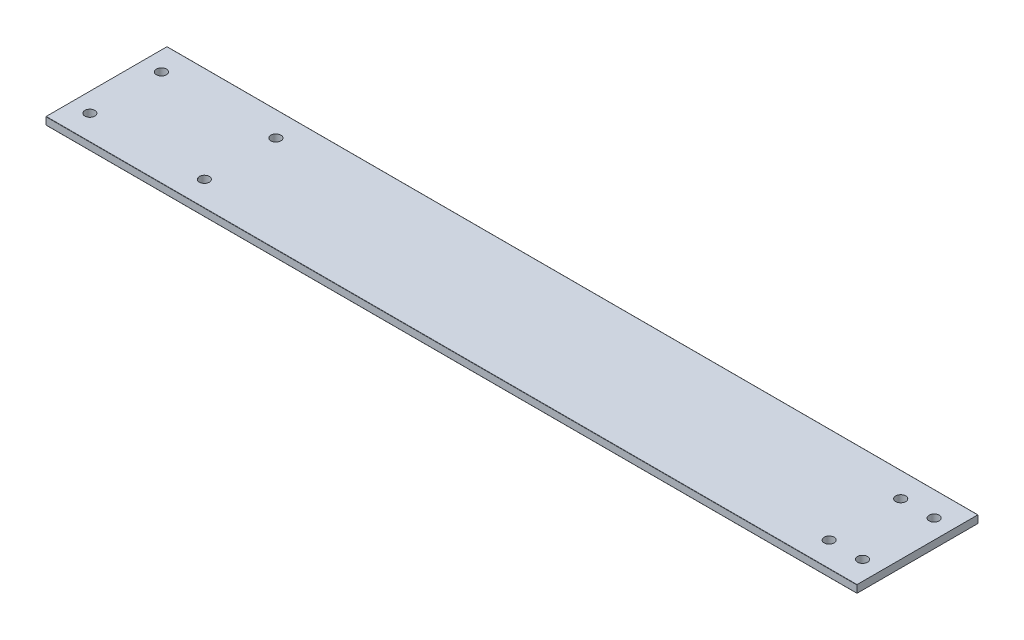
ISO-10303-21;
HEADER;
FILE_DESCRIPTION(('STEP AP214'),'2;1');
FILE_NAME('part.step','',(''),(''),'','','');
FILE_SCHEMA(('AUTOMOTIVE_DESIGN { 1 0 10303 214 1 1 1 1 }'));
ENDSEC;
DATA;
#1=APPLICATION_CONTEXT('core data for automotive mechanical design processes');
#2=APPLICATION_PROTOCOL_DEFINITION('international standard','automotive_design',2000,#1);
#3=PRODUCT_CONTEXT('',#1,'mechanical');
#4=PRODUCT('Part','Part','',(#3));
#5=PRODUCT_RELATED_PRODUCT_CATEGORY('part','',(#4));
#6=PRODUCT_DEFINITION_FORMATION('','',#4);
#7=PRODUCT_DEFINITION_CONTEXT('part definition',#1,'design');
#8=PRODUCT_DEFINITION('design','',#6,#7);
#9=PRODUCT_DEFINITION_SHAPE('','',#8);
#10=(LENGTH_UNIT() NAMED_UNIT(*) SI_UNIT(.MILLI.,.METRE.));
#11=(NAMED_UNIT(*) PLANE_ANGLE_UNIT() SI_UNIT($,.RADIAN.));
#12=(NAMED_UNIT(*) SI_UNIT($,.STERADIAN.) SOLID_ANGLE_UNIT());
#13=UNCERTAINTY_MEASURE_WITH_UNIT(LENGTH_MEASURE(1.E-05),#10,'distance_accuracy_value','');
#14=(GEOMETRIC_REPRESENTATION_CONTEXT(3) GLOBAL_UNCERTAINTY_ASSIGNED_CONTEXT((#13)) GLOBAL_UNIT_ASSIGNED_CONTEXT((#10,
#11,#12)) REPRESENTATION_CONTEXT('',''));
#15=CARTESIAN_POINT('',(0.,0.,0.));
#16=DIRECTION('',(0.,0.,1.));
#17=DIRECTION('',(1.,0.,0.));
#18=AXIS2_PLACEMENT_3D('',#15,#16,#17);
#19=CARTESIAN_POINT('',(-304.8,-1.58750000000001,-25.4));
#20=DIRECTION('',(-1.,0.,0.));
#21=DIRECTION('',(0.,0.,1.));
#22=AXIS2_PLACEMENT_3D('',#19,#20,#21);
#23=PLANE('',#22);
#24=DIRECTION('',(0.,0.,1.));
#25=VECTOR('',#24,1.);
#26=CARTESIAN_POINT('',(-304.8,-1.58750000000001,-25.4));
#27=LINE('',#26,#25);
#28=CARTESIAN_POINT('',(-304.8,-1.58750000000001,-25.295225));
#29=VERTEX_POINT('',#28);
#30=CARTESIAN_POINT('',(-304.8,-1.58750000000001,25.2952249999999));
#31=VERTEX_POINT('',#30);
#32=EDGE_CURVE('E176',#29,#31,#27,.T.);
#33=ORIENTED_EDGE('',*,*,#32,.T.);
#34=CARTESIAN_POINT('',(-304.8,-1.48272500000001,25.295225));
#35=DIRECTION('',(-1.,0.,0.));
#36=DIRECTION('',(0.,0.,1.));
#37=AXIS2_PLACEMENT_3D('',#34,#35,#36);
#38=CIRCLE('',#37,0.104775);
#39=CARTESIAN_POINT('',(-304.8,-1.48272500000001,25.4));
#40=VERTEX_POINT('',#39);
#41=EDGE_CURVE('E153',#31,#40,#38,.T.);
#42=ORIENTED_EDGE('',*,*,#41,.T.);
#43=DIRECTION('',(0.,1.,0.));
#44=VECTOR('',#43,1.);
#45=CARTESIAN_POINT('',(-304.8,-1.58750000000001,25.4));
#46=LINE('',#45,#44);
#47=CARTESIAN_POINT('',(-304.8,1.48272499999999,25.4));
#48=VERTEX_POINT('',#47);
#49=EDGE_CURVE('E136',#40,#48,#46,.T.);
#50=ORIENTED_EDGE('',*,*,#49,.T.);
#51=CARTESIAN_POINT('',(-304.8,1.48272499999999,25.295225));
#52=DIRECTION('',(-1.,0.,0.));
#53=DIRECTION('',(0.,0.,1.));
#54=AXIS2_PLACEMENT_3D('',#51,#52,#53);
#55=CIRCLE('',#54,0.104775);
#56=CARTESIAN_POINT('',(-304.8,1.58749999999999,25.2952249999999));
#57=VERTEX_POINT('',#56);
#58=EDGE_CURVE('E125',#48,#57,#55,.T.);
#59=ORIENTED_EDGE('',*,*,#58,.T.);
#60=DIRECTION('',(0.,0.,1.));
#61=VECTOR('',#60,1.);
#62=CARTESIAN_POINT('',(-304.8,1.58749999999999,-25.4));
#63=LINE('',#62,#61);
#64=CARTESIAN_POINT('',(-304.8,1.58749999999999,-25.295225));
#65=VERTEX_POINT('',#64);
#66=EDGE_CURVE('E170',#65,#57,#63,.T.);
#67=ORIENTED_EDGE('',*,*,#66,.F.);
#68=CARTESIAN_POINT('',(-304.8,1.48272499999999,-25.295225));
#69=DIRECTION('',(-1.,0.,0.));
#70=DIRECTION('',(0.,0.,1.));
#71=AXIS2_PLACEMENT_3D('',#68,#69,#70);
#72=CIRCLE('',#71,0.104775);
#73=CARTESIAN_POINT('',(-304.8,1.48272499999999,-25.4));
#74=VERTEX_POINT('',#73);
#75=EDGE_CURVE('E65',#65,#74,#72,.T.);
#76=ORIENTED_EDGE('',*,*,#75,.T.);
#77=DIRECTION('',(0.,1.,0.));
#78=VECTOR('',#77,1.);
#79=CARTESIAN_POINT('',(-304.8,-1.58750000000001,-25.4));
#80=LINE('',#79,#78);
#81=CARTESIAN_POINT('',(-304.8,-1.48272500000001,-25.4));
#82=VERTEX_POINT('',#81);
#83=EDGE_CURVE('E127',#82,#74,#80,.T.);
#84=ORIENTED_EDGE('',*,*,#83,.F.);
#85=CARTESIAN_POINT('',(-304.8,-1.48272500000001,-25.295225));
#86=DIRECTION('',(-1.,0.,0.));
#87=DIRECTION('',(0.,0.,1.));
#88=AXIS2_PLACEMENT_3D('',#85,#86,#87);
#89=CIRCLE('',#88,0.104775);
#90=EDGE_CURVE('E150',#82,#29,#89,.T.);
#91=ORIENTED_EDGE('',*,*,#90,.T.);
#92=EDGE_LOOP('',(#33,#42,#50,#59,#67,#76,#84,#91));
#93=FACE_BOUND('',#92,.T.);
#94=ADVANCED_FACE('F43',(#93),#23,.T.);
#95=CARTESIAN_POINT('',(-304.8,-1.58750000000001,-25.4));
#96=DIRECTION('',(0.,0.,-1.));
#97=DIRECTION('',(-1.,0.,0.));
#98=AXIS2_PLACEMENT_3D('',#95,#96,#97);
#99=PLANE('',#98);
#100=DIRECTION('',(0.,1.,0.));
#101=VECTOR('',#100,1.);
#102=CARTESIAN_POINT('',(35.1999999999999,-1.58749999998689,-25.4000000000027));
#103=LINE('',#102,#101);
#104=CARTESIAN_POINT('',(35.1999999999999,-1.48272500000001,-25.4000000000027));
#105=VERTEX_POINT('',#104);
#106=CARTESIAN_POINT('',(35.1999999999999,1.48272499999999,-25.4000000000027));
#107=VERTEX_POINT('',#106);
#108=EDGE_CURVE('E187',#105,#107,#103,.T.);
#109=ORIENTED_EDGE('',*,*,#108,.F.);
#110=DIRECTION('',(-1.,0.,0.));
#111=VECTOR('',#110,1.);
#112=CARTESIAN_POINT('',(-304.8,-1.48272500000001,-25.4));
#113=LINE('',#112,#111);
#114=EDGE_CURVE('E160',#105,#82,#113,.T.);
#115=ORIENTED_EDGE('',*,*,#114,.T.);
#116=ORIENTED_EDGE('',*,*,#83,.T.);
#117=DIRECTION('',(-1.,0.,0.));
#118=VECTOR('',#117,1.);
#119=CARTESIAN_POINT('',(-304.8,1.48272499999999,-25.4));
#120=LINE('',#119,#118);
#121=EDGE_CURVE('E156',#74,#107,#120,.F.);
#122=ORIENTED_EDGE('',*,*,#121,.T.);
#123=EDGE_LOOP('',(#109,#115,#116,#122));
#124=FACE_BOUND('',#123,.T.);
#125=ADVANCED_FACE('F265',(#124),#99,.T.);
#126=CARTESIAN_POINT('',(-304.8,-1.58750000000001,25.4));
#127=DIRECTION('',(0.,0.,1.));
#128=DIRECTION('',(1.,0.,0.));
#129=AXIS2_PLACEMENT_3D('',#126,#127,#128);
#130=PLANE('',#129);
#131=DIRECTION('',(0.,-1.,0.));
#132=VECTOR('',#131,1.);
#133=CARTESIAN_POINT('',(35.1999999999999,-1.58749999998689,25.3999999999973));
#134=LINE('',#133,#132);
#135=CARTESIAN_POINT('',(35.1999999999999,1.48272499999999,25.3999999999973));
#136=VERTEX_POINT('',#135);
#137=CARTESIAN_POINT('',(35.1999999999999,-1.48272500000001,25.3999999999973));
#138=VERTEX_POINT('',#137);
#139=EDGE_CURVE('E108',#136,#138,#134,.T.);
#140=ORIENTED_EDGE('',*,*,#139,.F.);
#141=DIRECTION('',(1.,0.,0.));
#142=VECTOR('',#141,1.);
#143=CARTESIAN_POINT('',(-304.8,1.48272499999999,25.4));
#144=LINE('',#143,#142);
#145=EDGE_CURVE('E118',#136,#48,#144,.F.);
#146=ORIENTED_EDGE('',*,*,#145,.T.);
#147=ORIENTED_EDGE('',*,*,#49,.F.);
#148=DIRECTION('',(1.,0.,0.));
#149=VECTOR('',#148,1.);
#150=CARTESIAN_POINT('',(304.8,-1.48272500000001,25.4));
#151=LINE('',#150,#149);
#152=EDGE_CURVE('E121',#40,#138,#151,.T.);
#153=ORIENTED_EDGE('',*,*,#152,.T.);
#154=EDGE_LOOP('',(#140,#146,#147,#153));
#155=FACE_BOUND('',#154,.T.);
#156=ADVANCED_FACE('F116',(#155),#130,.T.);
#157=CARTESIAN_POINT('',(0.,-1.58750000000001,0.));
#158=DIRECTION('',(0.,1.,0.));
#159=DIRECTION('',(0.,0.,1.));
#160=AXIS2_PLACEMENT_3D('',#157,#158,#159);
#161=PLANE('',#160);
#162=CARTESIAN_POINT('',(27.1999999999999,-1.58750000000001,14.9999999999826));
#163=DIRECTION('',(0.,-1.,0.));
#164=DIRECTION('',(0.,0.,-1.));
#165=AXIS2_PLACEMENT_3D('',#162,#163,#164);
#166=CIRCLE('',#165,2.10000000002007);
#167=CARTESIAN_POINT('',(27.1999999999999,-1.58750000000001,12.8999999999625));
#168=VERTEX_POINT('',#167);
#169=EDGE_CURVE('E196',#168,#168,#166,.T.);
#170=ORIENTED_EDGE('',*,*,#169,.F.);
#171=EDGE_LOOP('',(#170));
#172=FACE_BOUND('',#171,.T.);
#173=CARTESIAN_POINT('',(13.1989999999999,-1.58750000000001,14.9999999999826));
#174=DIRECTION('',(0.,-1.,0.));
#175=DIRECTION('',(0.,0.,-1.));
#176=AXIS2_PLACEMENT_3D('',#173,#174,#175);
#177=CIRCLE('',#176,2.10000000002007);
#178=CARTESIAN_POINT('',(13.1989999999999,-1.58750000000001,12.8999999999625));
#179=VERTEX_POINT('',#178);
#180=EDGE_CURVE('E215',#179,#179,#177,.T.);
#181=ORIENTED_EDGE('',*,*,#180,.F.);
#182=EDGE_LOOP('',(#181));
#183=FACE_BOUND('',#182,.T.);
#184=CARTESIAN_POINT('',(13.1989999999999,-1.58750000000001,-15.0000000000174));
#185=DIRECTION('',(0.,-1.,0.));
#186=DIRECTION('',(0.,0.,-1.));
#187=AXIS2_PLACEMENT_3D('',#184,#185,#186);
#188=CIRCLE('',#187,2.10000000002008);
#189=CARTESIAN_POINT('',(13.1989999999999,-1.58750000000001,-17.1000000000375));
#190=VERTEX_POINT('',#189);
#191=EDGE_CURVE('E209',#190,#190,#188,.T.);
#192=ORIENTED_EDGE('',*,*,#191,.F.);
#193=EDGE_LOOP('',(#192));
#194=FACE_BOUND('',#193,.T.);
#195=CARTESIAN_POINT('',(-248.8,-1.58750000000001,-15.0000000000174));
#196=DIRECTION('',(0.,-1.,0.));
#197=DIRECTION('',(0.,0.,-1.));
#198=AXIS2_PLACEMENT_3D('',#195,#196,#197);
#199=CIRCLE('',#198,2.10000000000129);
#200=CARTESIAN_POINT('',(-248.8,-1.58750000000001,-17.1000000000187));
#201=VERTEX_POINT('',#200);
#202=EDGE_CURVE('E202',#201,#201,#199,.T.);
#203=ORIENTED_EDGE('',*,*,#202,.F.);
#204=EDGE_LOOP('',(#203));
#205=FACE_BOUND('',#204,.T.);
#206=CARTESIAN_POINT('',(-248.8,-1.58750000000001,14.9999999999956));
#207=DIRECTION('',(0.,-1.,0.));
#208=DIRECTION('',(0.,0.,-1.));
#209=AXIS2_PLACEMENT_3D('',#206,#207,#208);
#210=CIRCLE('',#209,2.10000000000127);
#211=CARTESIAN_POINT('',(-248.8,-1.58750000000001,12.8999999999943));
#212=VERTEX_POINT('',#211);
#213=EDGE_CURVE('E203',#212,#212,#210,.T.);
#214=ORIENTED_EDGE('',*,*,#213,.F.);
#215=EDGE_LOOP('',(#214));
#216=FACE_BOUND('',#215,.T.);
#217=CARTESIAN_POINT('',(-296.8,-1.58750000000001,14.9999999999826));
#218=DIRECTION('',(0.,-1.,0.));
#219=DIRECTION('',(0.,0.,-1.));
#220=AXIS2_PLACEMENT_3D('',#217,#218,#219);
#221=CIRCLE('',#220,2.10000000000129);
#222=CARTESIAN_POINT('',(-296.8,-1.58750000000001,12.8999999999813));
#223=VERTEX_POINT('',#222);
#224=EDGE_CURVE('E232',#223,#223,#221,.T.);
#225=ORIENTED_EDGE('',*,*,#224,.F.);
#226=EDGE_LOOP('',(#225));
#227=FACE_BOUND('',#226,.T.);
#228=CARTESIAN_POINT('',(-296.8,-1.58750000000001,-15.0000000000044));
#229=DIRECTION('',(0.,-1.,0.));
#230=DIRECTION('',(0.,0.,-1.));
#231=AXIS2_PLACEMENT_3D('',#228,#229,#230);
#232=CIRCLE('',#231,2.10000000000127);
#233=CARTESIAN_POINT('',(-296.8,-1.58750000000001,-17.1000000000057));
#234=VERTEX_POINT('',#233);
#235=EDGE_CURVE('E226',#234,#234,#232,.T.);
#236=ORIENTED_EDGE('',*,*,#235,.F.);
#237=EDGE_LOOP('',(#236));
#238=FACE_BOUND('',#237,.T.);
#239=CARTESIAN_POINT('',(27.1999999999999,-1.58750000000001,-15.0000000000174));
#240=DIRECTION('',(0.,-1.,0.));
#241=DIRECTION('',(0.,0.,-1.));
#242=AXIS2_PLACEMENT_3D('',#239,#240,#241);
#243=CIRCLE('',#242,2.10000000002007);
#244=CARTESIAN_POINT('',(27.1999999999999,-1.58750000000001,-17.1000000000375));
#245=VERTEX_POINT('',#244);
#246=EDGE_CURVE('E193',#245,#245,#243,.T.);
#247=ORIENTED_EDGE('',*,*,#246,.F.);
#248=EDGE_LOOP('',(#247));
#249=FACE_BOUND('',#248,.T.);
#250=DIRECTION('',(-1.,0.,0.));
#251=VECTOR('',#250,1.);
#252=CARTESIAN_POINT('',(304.8,-1.58750000000001,-25.295225));
#253=LINE('',#252,#251);
#254=CARTESIAN_POINT('',(35.1999999999999,-1.58749999998689,-25.295225));
#255=VERTEX_POINT('',#254);
#256=EDGE_CURVE('E133',#29,#255,#253,.F.);
#257=ORIENTED_EDGE('',*,*,#256,.T.);
#258=DIRECTION('',(0.,0.,-1.));
#259=VECTOR('',#258,1.);
#260=CARTESIAN_POINT('',(35.1999999999999,-1.58749999998689,25.3999999999973));
#261=LINE('',#260,#259);
#262=CARTESIAN_POINT('',(35.1999999999999,-1.58749999998689,25.295225));
#263=VERTEX_POINT('',#262);
#264=EDGE_CURVE('E189',#263,#255,#261,.T.);
#265=ORIENTED_EDGE('',*,*,#264,.F.);
#266=DIRECTION('',(1.,0.,0.));
#267=VECTOR('',#266,1.);
#268=CARTESIAN_POINT('',(-304.8,-1.58750000000001,25.295225));
#269=LINE('',#268,#267);
#270=EDGE_CURVE('E143',#263,#31,#269,.F.);
#271=ORIENTED_EDGE('',*,*,#270,.T.);
#272=ORIENTED_EDGE('',*,*,#32,.F.);
#273=EDGE_LOOP('',(#257,#265,#271,#272));
#274=FACE_BOUND('',#273,.T.);
#275=ADVANCED_FACE('F243',(#172,#183,#194,#205,#216,#227,#238,#249,#274),#161,.F.);
#276=CARTESIAN_POINT('',(0.,1.58749999999999,0.));
#277=DIRECTION('',(0.,1.,0.));
#278=DIRECTION('',(0.,0.,1.));
#279=AXIS2_PLACEMENT_3D('',#276,#277,#278);
#280=PLANE('',#279);
#281=CARTESIAN_POINT('',(27.1999999999999,1.58750000001316,14.9999999999826));
#282=DIRECTION('',(0.,-1.,0.));
#283=DIRECTION('',(0.,0.,-1.));
#284=AXIS2_PLACEMENT_3D('',#281,#282,#283);
#285=CIRCLE('',#284,2.10000000002007);
#286=CARTESIAN_POINT('',(27.1999999999999,1.58750000001316,12.8999999999625));
#287=VERTEX_POINT('',#286);
#288=EDGE_CURVE('E218',#287,#287,#285,.T.);
#289=ORIENTED_EDGE('',*,*,#288,.T.);
#290=EDGE_LOOP('',(#289));
#291=FACE_BOUND('',#290,.T.);
#292=CARTESIAN_POINT('',(13.1989999999999,1.58750000001316,14.9999999999826));
#293=DIRECTION('',(0.,-1.,0.));
#294=DIRECTION('',(0.,0.,-1.));
#295=AXIS2_PLACEMENT_3D('',#292,#293,#294);
#296=CIRCLE('',#295,2.10000000002007);
#297=CARTESIAN_POINT('',(13.1989999999999,1.58750000001316,12.8999999999625));
#298=VERTEX_POINT('',#297);
#299=EDGE_CURVE('E212',#298,#298,#296,.T.);
#300=ORIENTED_EDGE('',*,*,#299,.T.);
#301=EDGE_LOOP('',(#300));
#302=FACE_BOUND('',#301,.T.);
#303=CARTESIAN_POINT('',(13.1989999999999,1.58750000001316,-15.0000000000174));
#304=DIRECTION('',(0.,-1.,0.));
#305=DIRECTION('',(0.,0.,-1.));
#306=AXIS2_PLACEMENT_3D('',#303,#304,#305);
#307=CIRCLE('',#306,2.10000000002008);
#308=CARTESIAN_POINT('',(13.1989999999999,1.58750000001316,-17.1000000000375));
#309=VERTEX_POINT('',#308);
#310=EDGE_CURVE('E206',#309,#309,#307,.T.);
#311=ORIENTED_EDGE('',*,*,#310,.T.);
#312=EDGE_LOOP('',(#311));
#313=FACE_BOUND('',#312,.T.);
#314=CARTESIAN_POINT('',(-248.8,1.58750000001316,-15.0000000000174));
#315=DIRECTION('',(0.,-1.,0.));
#316=DIRECTION('',(0.,0.,-1.));
#317=AXIS2_PLACEMENT_3D('',#314,#315,#316);
#318=CIRCLE('',#317,2.10000000000129);
#319=CARTESIAN_POINT('',(-248.8,1.58750000001316,-17.1000000000187));
#320=VERTEX_POINT('',#319);
#321=EDGE_CURVE('E199',#320,#320,#318,.T.);
#322=ORIENTED_EDGE('',*,*,#321,.T.);
#323=EDGE_LOOP('',(#322));
#324=FACE_BOUND('',#323,.T.);
#325=CARTESIAN_POINT('',(-248.8,1.58750000001316,14.9999999999956));
#326=DIRECTION('',(0.,-1.,0.));
#327=DIRECTION('',(0.,0.,-1.));
#328=AXIS2_PLACEMENT_3D('',#325,#326,#327);
#329=CIRCLE('',#328,2.10000000000127);
#330=CARTESIAN_POINT('',(-248.8,1.58750000001316,12.8999999999943));
#331=VERTEX_POINT('',#330);
#332=EDGE_CURVE('E235',#331,#331,#329,.T.);
#333=ORIENTED_EDGE('',*,*,#332,.T.);
#334=EDGE_LOOP('',(#333));
#335=FACE_BOUND('',#334,.T.);
#336=CARTESIAN_POINT('',(-296.8,1.58750000001316,14.9999999999826));
#337=DIRECTION('',(0.,-1.,0.));
#338=DIRECTION('',(0.,0.,-1.));
#339=AXIS2_PLACEMENT_3D('',#336,#337,#338);
#340=CIRCLE('',#339,2.10000000000129);
#341=CARTESIAN_POINT('',(-296.8,1.58750000001316,12.8999999999813));
#342=VERTEX_POINT('',#341);
#343=EDGE_CURVE('E229',#342,#342,#340,.T.);
#344=ORIENTED_EDGE('',*,*,#343,.T.);
#345=EDGE_LOOP('',(#344));
#346=FACE_BOUND('',#345,.T.);
#347=CARTESIAN_POINT('',(-296.8,1.58750000001316,-15.0000000000044));
#348=DIRECTION('',(0.,-1.,0.));
#349=DIRECTION('',(0.,0.,-1.));
#350=AXIS2_PLACEMENT_3D('',#347,#348,#349);
#351=CIRCLE('',#350,2.10000000000127);
#352=CARTESIAN_POINT('',(-296.8,1.58750000001316,-17.1000000000057));
#353=VERTEX_POINT('',#352);
#354=EDGE_CURVE('E223',#353,#353,#351,.T.);
#355=ORIENTED_EDGE('',*,*,#354,.T.);
#356=EDGE_LOOP('',(#355));
#357=FACE_BOUND('',#356,.T.);
#358=CARTESIAN_POINT('',(27.1999999999999,1.58750000001316,-15.0000000000174));
#359=DIRECTION('',(0.,-1.,0.));
#360=DIRECTION('',(0.,0.,-1.));
#361=AXIS2_PLACEMENT_3D('',#358,#359,#360);
#362=CIRCLE('',#361,2.10000000002007);
#363=CARTESIAN_POINT('',(27.1999999999999,1.58750000001316,-17.1000000000375));
#364=VERTEX_POINT('',#363);
#365=EDGE_CURVE('E192',#364,#364,#362,.T.);
#366=ORIENTED_EDGE('',*,*,#365,.T.);
#367=EDGE_LOOP('',(#366));
#368=FACE_BOUND('',#367,.T.);
#369=DIRECTION('',(0.,0.,1.));
#370=VECTOR('',#369,1.);
#371=CARTESIAN_POINT('',(35.1999999999999,1.58750000001316,25.3999999999973));
#372=LINE('',#371,#370);
#373=CARTESIAN_POINT('',(35.1999999999999,1.58750000001316,-25.295225));
#374=VERTEX_POINT('',#373);
#375=CARTESIAN_POINT('',(35.1999999999999,1.58749999999999,25.295225));
#376=VERTEX_POINT('',#375);
#377=EDGE_CURVE('E57',#374,#376,#372,.T.);
#378=ORIENTED_EDGE('',*,*,#377,.F.);
#379=DIRECTION('',(-1.,0.,0.));
#380=VECTOR('',#379,1.);
#381=CARTESIAN_POINT('',(0.,1.58749999999999,-25.295225));
#382=LINE('',#381,#380);
#383=EDGE_CURVE('E51',#374,#65,#382,.T.);
#384=ORIENTED_EDGE('',*,*,#383,.T.);
#385=ORIENTED_EDGE('',*,*,#66,.T.);
#386=DIRECTION('',(1.,0.,0.));
#387=VECTOR('',#386,1.);
#388=CARTESIAN_POINT('',(0.,1.58749999999999,25.295225));
#389=LINE('',#388,#387);
#390=EDGE_CURVE('E163',#57,#376,#389,.T.);
#391=ORIENTED_EDGE('',*,*,#390,.T.);
#392=EDGE_LOOP('',(#378,#384,#385,#391));
#393=FACE_BOUND('',#392,.T.);
#394=ADVANCED_FACE('F169',(#291,#302,#313,#324,#335,#346,#357,#368,#393),#280,.T.);
#395=CARTESIAN_POINT('',(-304.8,-1.48272500000001,25.295225));
#396=DIRECTION('',(-1.,0.,0.));
#397=DIRECTION('',(0.,0.,1.));
#398=AXIS2_PLACEMENT_3D('',#395,#396,#397);
#399=CYLINDRICAL_SURFACE('',#398,0.104775);
#400=CARTESIAN_POINT('',(35.1999999999999,-1.48272500000001,25.295225));
#401=DIRECTION('',(-1.,0.,0.));
#402=DIRECTION('',(0.,0.,1.));
#403=AXIS2_PLACEMENT_3D('',#400,#401,#402);
#404=CIRCLE('',#403,0.104775);
#405=EDGE_CURVE('E177',#138,#263,#404,.F.);
#406=ORIENTED_EDGE('',*,*,#405,.F.);
#407=ORIENTED_EDGE('',*,*,#152,.F.);
#408=ORIENTED_EDGE('',*,*,#41,.F.);
#409=ORIENTED_EDGE('',*,*,#270,.F.);
#410=EDGE_LOOP('',(#406,#407,#408,#409));
#411=FACE_BOUND('',#410,.T.);
#412=ADVANCED_FACE('F268',(#411),#399,.T.);
#413=CARTESIAN_POINT('',(-304.8,-1.48272500000001,-25.295225));
#414=DIRECTION('',(1.,0.,0.));
#415=DIRECTION('',(0.,0.,-1.));
#416=AXIS2_PLACEMENT_3D('',#413,#414,#415);
#417=CYLINDRICAL_SURFACE('',#416,0.104775);
#418=CARTESIAN_POINT('',(35.1999999999999,-1.48272500000001,-25.295225));
#419=DIRECTION('',(-1.,0.,0.));
#420=DIRECTION('',(0.,0.,1.));
#421=AXIS2_PLACEMENT_3D('',#418,#419,#420);
#422=CIRCLE('',#421,0.104775);
#423=EDGE_CURVE('E182',#255,#105,#422,.F.);
#424=ORIENTED_EDGE('',*,*,#423,.F.);
#425=ORIENTED_EDGE('',*,*,#256,.F.);
#426=ORIENTED_EDGE('',*,*,#90,.F.);
#427=ORIENTED_EDGE('',*,*,#114,.F.);
#428=EDGE_LOOP('',(#424,#425,#426,#427));
#429=FACE_BOUND('',#428,.T.);
#430=ADVANCED_FACE('F261',(#429),#417,.T.);
#431=CARTESIAN_POINT('',(0.,1.48272499999999,-25.295225));
#432=DIRECTION('',(-1.,0.,0.));
#433=DIRECTION('',(0.,0.,1.));
#434=AXIS2_PLACEMENT_3D('',#431,#432,#433);
#435=CYLINDRICAL_SURFACE('',#434,0.104775);
#436=CARTESIAN_POINT('',(35.1999999999999,1.48272499999999,-25.295225));
#437=DIRECTION('',(-1.,0.,0.));
#438=DIRECTION('',(0.,0.,1.));
#439=AXIS2_PLACEMENT_3D('',#436,#437,#438);
#440=CIRCLE('',#439,0.104775);
#441=EDGE_CURVE('E122',#107,#374,#440,.F.);
#442=ORIENTED_EDGE('',*,*,#441,.F.);
#443=ORIENTED_EDGE('',*,*,#121,.F.);
#444=ORIENTED_EDGE('',*,*,#75,.F.);
#445=ORIENTED_EDGE('',*,*,#383,.F.);
#446=EDGE_LOOP('',(#442,#443,#444,#445));
#447=FACE_BOUND('',#446,.T.);
#448=ADVANCED_FACE('F174',(#447),#435,.T.);
#449=CARTESIAN_POINT('',(0.,1.48272499999999,25.295225));
#450=DIRECTION('',(1.,0.,0.));
#451=DIRECTION('',(0.,0.,-1.));
#452=AXIS2_PLACEMENT_3D('',#449,#450,#451);
#453=CYLINDRICAL_SURFACE('',#452,0.104775);
#454=CARTESIAN_POINT('',(35.1999999999999,1.48272499999999,25.295225));
#455=DIRECTION('',(-1.,0.,0.));
#456=DIRECTION('',(0.,0.,1.));
#457=AXIS2_PLACEMENT_3D('',#454,#455,#456);
#458=CIRCLE('',#457,0.104775);
#459=EDGE_CURVE('E11',#376,#136,#458,.F.);
#460=ORIENTED_EDGE('',*,*,#459,.F.);
#461=ORIENTED_EDGE('',*,*,#390,.F.);
#462=ORIENTED_EDGE('',*,*,#58,.F.);
#463=ORIENTED_EDGE('',*,*,#145,.F.);
#464=EDGE_LOOP('',(#460,#461,#462,#463));
#465=FACE_BOUND('',#464,.T.);
#466=ADVANCED_FACE('F45',(#465),#453,.T.);
#467=CARTESIAN_POINT('',(35.1999999999999,162.45592766042,-35.7000000000172));
#468=DIRECTION('',(-1.,0.,0.));
#469=DIRECTION('',(0.,-0.866025403784439,0.499999999999999));
#470=AXIS2_PLACEMENT_3D('',#467,#468,#469);
#471=PLANE('',#470);
#472=ORIENTED_EDGE('',*,*,#405,.T.);
#473=ORIENTED_EDGE('',*,*,#264,.T.);
#474=ORIENTED_EDGE('',*,*,#423,.T.);
#475=ORIENTED_EDGE('',*,*,#108,.T.);
#476=ORIENTED_EDGE('',*,*,#441,.T.);
#477=ORIENTED_EDGE('',*,*,#377,.T.);
#478=ORIENTED_EDGE('',*,*,#459,.T.);
#479=ORIENTED_EDGE('',*,*,#139,.T.);
#480=EDGE_LOOP('',(#472,#473,#474,#475,#476,#477,#478,#479));
#481=FACE_BOUND('',#480,.T.);
#482=ADVANCED_FACE('F107',(#481),#471,.F.);
#483=CARTESIAN_POINT('',(27.1999999999999,1.58750000001316,-15.0000000000174));
#484=DIRECTION('',(0.,-1.,0.));
#485=DIRECTION('',(0.,0.,-1.));
#486=AXIS2_PLACEMENT_3D('',#483,#484,#485);
#487=CYLINDRICAL_SURFACE('',#486,2.10000000002007);
#488=ORIENTED_EDGE('',*,*,#365,.F.);
#489=EDGE_LOOP('',(#488));
#490=FACE_BOUND('',#489,.T.);
#491=ORIENTED_EDGE('',*,*,#246,.T.);
#492=EDGE_LOOP('',(#491));
#493=FACE_BOUND('',#492,.T.);
#494=ADVANCED_FACE('F290',(#490,#493),#487,.F.);
#495=CARTESIAN_POINT('',(-296.8,1.58750000001316,-15.0000000000044));
#496=DIRECTION('',(0.,-1.,0.));
#497=DIRECTION('',(0.,0.,-1.));
#498=AXIS2_PLACEMENT_3D('',#495,#496,#497);
#499=CYLINDRICAL_SURFACE('',#498,2.10000000000127);
#500=ORIENTED_EDGE('',*,*,#354,.F.);
#501=EDGE_LOOP('',(#500));
#502=FACE_BOUND('',#501,.T.);
#503=ORIENTED_EDGE('',*,*,#235,.T.);
#504=EDGE_LOOP('',(#503));
#505=FACE_BOUND('',#504,.T.);
#506=ADVANCED_FACE('F293',(#502,#505),#499,.F.);
#507=CARTESIAN_POINT('',(-296.8,1.58750000001316,14.9999999999826));
#508=DIRECTION('',(0.,-1.,0.));
#509=DIRECTION('',(0.,0.,-1.));
#510=AXIS2_PLACEMENT_3D('',#507,#508,#509);
#511=CYLINDRICAL_SURFACE('',#510,2.10000000000129);
#512=ORIENTED_EDGE('',*,*,#343,.F.);
#513=EDGE_LOOP('',(#512));
#514=FACE_BOUND('',#513,.T.);
#515=ORIENTED_EDGE('',*,*,#224,.T.);
#516=EDGE_LOOP('',(#515));
#517=FACE_BOUND('',#516,.T.);
#518=ADVANCED_FACE('F313',(#514,#517),#511,.F.);
#519=CARTESIAN_POINT('',(-248.8,1.58750000001316,14.9999999999956));
#520=DIRECTION('',(0.,-1.,0.));
#521=DIRECTION('',(0.,0.,-1.));
#522=AXIS2_PLACEMENT_3D('',#519,#520,#521);
#523=CYLINDRICAL_SURFACE('',#522,2.10000000000127);
#524=ORIENTED_EDGE('',*,*,#332,.F.);
#525=EDGE_LOOP('',(#524));
#526=FACE_BOUND('',#525,.T.);
#527=ORIENTED_EDGE('',*,*,#213,.T.);
#528=EDGE_LOOP('',(#527));
#529=FACE_BOUND('',#528,.T.);
#530=ADVANCED_FACE('F241',(#526,#529),#523,.F.);
#531=CARTESIAN_POINT('',(-248.8,1.58750000001316,-15.0000000000174));
#532=DIRECTION('',(0.,-1.,0.));
#533=DIRECTION('',(0.,0.,-1.));
#534=AXIS2_PLACEMENT_3D('',#531,#532,#533);
#535=CYLINDRICAL_SURFACE('',#534,2.10000000000129);
#536=ORIENTED_EDGE('',*,*,#321,.F.);
#537=EDGE_LOOP('',(#536));
#538=FACE_BOUND('',#537,.T.);
#539=ORIENTED_EDGE('',*,*,#202,.T.);
#540=EDGE_LOOP('',(#539));
#541=FACE_BOUND('',#540,.T.);
#542=ADVANCED_FACE('F295',(#538,#541),#535,.F.);
#543=CARTESIAN_POINT('',(13.1989999999999,1.58750000001316,-15.0000000000174));
#544=DIRECTION('',(0.,-1.,0.));
#545=DIRECTION('',(0.,0.,-1.));
#546=AXIS2_PLACEMENT_3D('',#543,#544,#545);
#547=CYLINDRICAL_SURFACE('',#546,2.10000000002008);
#548=ORIENTED_EDGE('',*,*,#310,.F.);
#549=EDGE_LOOP('',(#548));
#550=FACE_BOUND('',#549,.T.);
#551=ORIENTED_EDGE('',*,*,#191,.T.);
#552=EDGE_LOOP('',(#551));
#553=FACE_BOUND('',#552,.T.);
#554=ADVANCED_FACE('F298',(#550,#553),#547,.F.);
#555=CARTESIAN_POINT('',(13.1989999999999,1.58750000001316,14.9999999999826));
#556=DIRECTION('',(0.,-1.,0.));
#557=DIRECTION('',(0.,0.,-1.));
#558=AXIS2_PLACEMENT_3D('',#555,#556,#557);
#559=CYLINDRICAL_SURFACE('',#558,2.10000000002007);
#560=ORIENTED_EDGE('',*,*,#299,.F.);
#561=EDGE_LOOP('',(#560));
#562=FACE_BOUND('',#561,.T.);
#563=ORIENTED_EDGE('',*,*,#180,.T.);
#564=EDGE_LOOP('',(#563));
#565=FACE_BOUND('',#564,.T.);
#566=ADVANCED_FACE('F302',(#562,#565),#559,.F.);
#567=CARTESIAN_POINT('',(27.1999999999999,1.58750000001316,14.9999999999826));
#568=DIRECTION('',(0.,-1.,0.));
#569=DIRECTION('',(0.,0.,-1.));
#570=AXIS2_PLACEMENT_3D('',#567,#568,#569);
#571=CYLINDRICAL_SURFACE('',#570,2.10000000002007);
#572=ORIENTED_EDGE('',*,*,#288,.F.);
#573=EDGE_LOOP('',(#572));
#574=FACE_BOUND('',#573,.T.);
#575=ORIENTED_EDGE('',*,*,#169,.T.);
#576=EDGE_LOOP('',(#575));
#577=FACE_BOUND('',#576,.T.);
#578=ADVANCED_FACE('F306',(#574,#577),#571,.F.);
#579=CLOSED_SHELL('',(#94,#125,#156,#275,#394,#412,#430,#448,#466,#482,#494,#506,#518,#530,#542,
#554,#566,#578));
#580=MANIFOLD_SOLID_BREP('B2',#579);
#581=ADVANCED_BREP_SHAPE_REPRESENTATION('',(#18,#580),#14);
#582=SHAPE_DEFINITION_REPRESENTATION(#9,#581);
ENDSEC;
END-ISO-10303-21;
